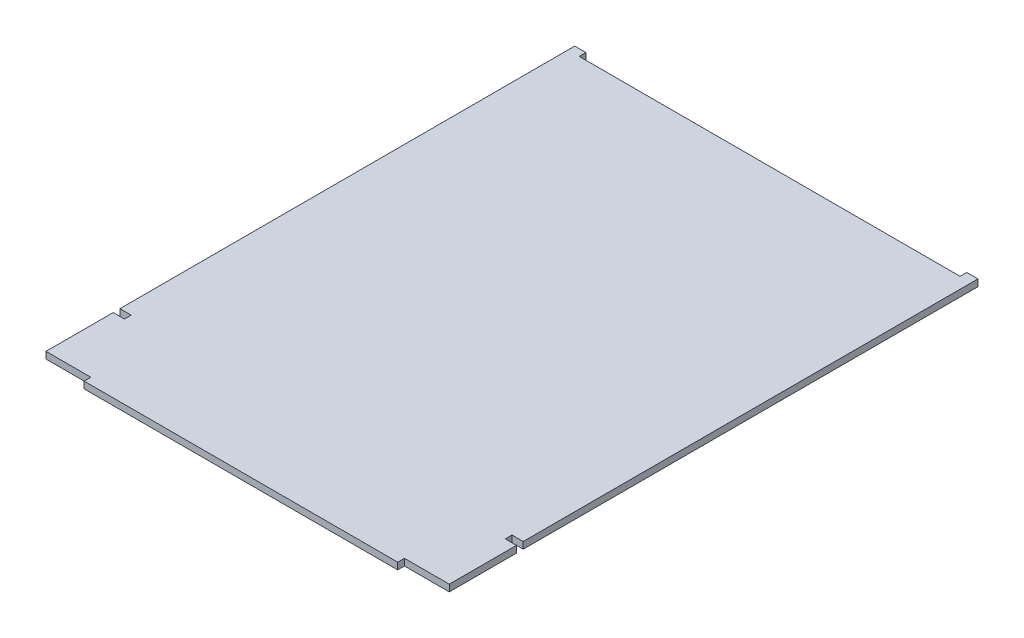
ISO-10303-21;
HEADER;
FILE_DESCRIPTION(('STEP AP214'),'2;1');
FILE_NAME('part.step','',(''),(''),'','','');
FILE_SCHEMA(('AUTOMOTIVE_DESIGN { 1 0 10303 214 1 1 1 1 }'));
ENDSEC;
DATA;
#1=APPLICATION_CONTEXT('core data for automotive mechanical design processes');
#2=APPLICATION_PROTOCOL_DEFINITION('international standard','automotive_design',2000,#1);
#3=PRODUCT_CONTEXT('',#1,'mechanical');
#4=PRODUCT('Part','Part','',(#3));
#5=PRODUCT_RELATED_PRODUCT_CATEGORY('part','',(#4));
#6=PRODUCT_DEFINITION_FORMATION('','',#4);
#7=PRODUCT_DEFINITION_CONTEXT('part definition',#1,'design');
#8=PRODUCT_DEFINITION('design','',#6,#7);
#9=PRODUCT_DEFINITION_SHAPE('','',#8);
#10=(LENGTH_UNIT() NAMED_UNIT(*) SI_UNIT(.MILLI.,.METRE.));
#11=(NAMED_UNIT(*) PLANE_ANGLE_UNIT() SI_UNIT($,.RADIAN.));
#12=(NAMED_UNIT(*) SI_UNIT($,.STERADIAN.) SOLID_ANGLE_UNIT());
#13=UNCERTAINTY_MEASURE_WITH_UNIT(LENGTH_MEASURE(1.E-05),#10,'distance_accuracy_value','');
#14=(GEOMETRIC_REPRESENTATION_CONTEXT(3) GLOBAL_UNCERTAINTY_ASSIGNED_CONTEXT((#13)) GLOBAL_UNIT_ASSIGNED_CONTEXT((#10,
#11,#12)) REPRESENTATION_CONTEXT('',''));
#15=CARTESIAN_POINT('',(0.,0.,0.));
#16=DIRECTION('',(0.,0.,1.));
#17=DIRECTION('',(1.,0.,0.));
#18=AXIS2_PLACEMENT_3D('',#15,#16,#17);
#19=CARTESIAN_POINT('',(0.,3.,3.));
#20=DIRECTION('',(0.,0.,-1.));
#21=DIRECTION('',(-1.,0.,0.));
#22=AXIS2_PLACEMENT_3D('',#19,#20,#21);
#23=PLANE('',#22);
#24=DIRECTION('',(1.,0.,0.));
#25=VECTOR('',#24,1.);
#26=CARTESIAN_POINT('',(0.,0.,3.));
#27=LINE('',#26,#25);
#28=CARTESIAN_POINT('',(160.,0.,3.));
#29=VERTEX_POINT('',#28);
#30=CARTESIAN_POINT('',(180.,0.,3.));
#31=VERTEX_POINT('',#30);
#32=EDGE_CURVE('E213',#29,#31,#27,.T.);
#33=ORIENTED_EDGE('',*,*,#32,.T.);
#34=DIRECTION('',(0.,-1.,0.));
#35=VECTOR('',#34,1.);
#36=CARTESIAN_POINT('',(180.,3.,3.));
#37=LINE('',#36,#35);
#38=CARTESIAN_POINT('',(180.,3.,3.));
#39=VERTEX_POINT('',#38);
#40=EDGE_CURVE('E11',#39,#31,#37,.T.);
#41=ORIENTED_EDGE('',*,*,#40,.F.);
#42=DIRECTION('',(1.,0.,0.));
#43=VECTOR('',#42,1.);
#44=CARTESIAN_POINT('',(0.,3.,3.));
#45=LINE('',#44,#43);
#46=CARTESIAN_POINT('',(160.,3.,3.));
#47=VERTEX_POINT('',#46);
#48=EDGE_CURVE('E284',#47,#39,#45,.T.);
#49=ORIENTED_EDGE('',*,*,#48,.F.);
#50=DIRECTION('',(0.,-1.,0.));
#51=VECTOR('',#50,1.);
#52=CARTESIAN_POINT('',(160.,3.,3.));
#53=LINE('',#52,#51);
#54=EDGE_CURVE('E209',#47,#29,#53,.T.);
#55=ORIENTED_EDGE('',*,*,#54,.T.);
#56=EDGE_LOOP('',(#33,#41,#49,#55));
#57=FACE_BOUND('',#56,.T.);
#58=ADVANCED_FACE('F39',(#57),#23,.F.);
#59=CARTESIAN_POINT('',(180.,3.,0.));
#60=DIRECTION('',(-1.,0.,0.));
#61=DIRECTION('',(0.,0.,1.));
#62=AXIS2_PLACEMENT_3D('',#59,#60,#61);
#63=PLANE('',#62);
#64=DIRECTION('',(0.,0.,-1.));
#65=VECTOR('',#64,1.);
#66=CARTESIAN_POINT('',(180.,0.,0.));
#67=LINE('',#66,#65);
#68=CARTESIAN_POINT('',(180.,0.,-27.));
#69=VERTEX_POINT('',#68);
#70=EDGE_CURVE('E217',#31,#69,#67,.T.);
#71=ORIENTED_EDGE('',*,*,#70,.T.);
#72=DIRECTION('',(0.,-1.,0.));
#73=VECTOR('',#72,1.);
#74=CARTESIAN_POINT('',(180.,3.,-27.));
#75=LINE('',#74,#73);
#76=CARTESIAN_POINT('',(180.,3.,-27.));
#77=VERTEX_POINT('',#76);
#78=EDGE_CURVE('E48',#77,#69,#75,.T.);
#79=ORIENTED_EDGE('',*,*,#78,.F.);
#80=DIRECTION('',(0.,0.,-1.));
#81=VECTOR('',#80,1.);
#82=CARTESIAN_POINT('',(180.,3.,0.));
#83=LINE('',#82,#81);
#84=EDGE_CURVE('E135',#39,#77,#83,.T.);
#85=ORIENTED_EDGE('',*,*,#84,.F.);
#86=ORIENTED_EDGE('',*,*,#40,.T.);
#87=EDGE_LOOP('',(#71,#79,#85,#86));
#88=FACE_BOUND('',#87,.T.);
#89=ADVANCED_FACE('F341',(#88),#63,.F.);
#90=CARTESIAN_POINT('',(0.,3.,-27.));
#91=DIRECTION('',(0.,0.,-1.));
#92=DIRECTION('',(-1.,0.,0.));
#93=AXIS2_PLACEMENT_3D('',#90,#91,#92);
#94=PLANE('',#93);
#95=DIRECTION('',(1.,0.,0.));
#96=VECTOR('',#95,1.);
#97=CARTESIAN_POINT('',(0.,0.,-27.));
#98=LINE('',#97,#96);
#99=CARTESIAN_POINT('',(175.,0.,-27.));
#100=VERTEX_POINT('',#99);
#101=EDGE_CURVE('E221',#100,#69,#98,.T.);
#102=ORIENTED_EDGE('',*,*,#101,.F.);
#103=DIRECTION('',(0.,-1.,0.));
#104=VECTOR('',#103,1.);
#105=CARTESIAN_POINT('',(175.,3.,-27.));
#106=LINE('',#105,#104);
#107=CARTESIAN_POINT('',(175.,3.,-27.));
#108=VERTEX_POINT('',#107);
#109=EDGE_CURVE('E332',#108,#100,#106,.T.);
#110=ORIENTED_EDGE('',*,*,#109,.F.);
#111=DIRECTION('',(1.,0.,0.));
#112=VECTOR('',#111,1.);
#113=CARTESIAN_POINT('',(0.,3.,-27.));
#114=LINE('',#113,#112);
#115=EDGE_CURVE('E340',#108,#77,#114,.T.);
#116=ORIENTED_EDGE('',*,*,#115,.T.);
#117=ORIENTED_EDGE('',*,*,#78,.T.);
#118=EDGE_LOOP('',(#102,#110,#116,#117));
#119=FACE_BOUND('',#118,.T.);
#120=ADVANCED_FACE('F338',(#119),#94,.T.);
#121=CARTESIAN_POINT('',(175.,3.,0.));
#122=DIRECTION('',(1.,0.,0.));
#123=DIRECTION('',(0.,0.,-1.));
#124=AXIS2_PLACEMENT_3D('',#121,#122,#123);
#125=PLANE('',#124);
#126=DIRECTION('',(0.,0.,1.));
#127=VECTOR('',#126,1.);
#128=CARTESIAN_POINT('',(175.,0.,0.));
#129=LINE('',#128,#127);
#130=CARTESIAN_POINT('',(175.,0.,-30.));
#131=VERTEX_POINT('',#130);
#132=EDGE_CURVE('E225',#131,#100,#129,.T.);
#133=ORIENTED_EDGE('',*,*,#132,.F.);
#134=DIRECTION('',(0.,-1.,0.));
#135=VECTOR('',#134,1.);
#136=CARTESIAN_POINT('',(175.,3.,-30.));
#137=LINE('',#136,#135);
#138=CARTESIAN_POINT('',(175.,3.,-30.));
#139=VERTEX_POINT('',#138);
#140=EDGE_CURVE('E329',#139,#131,#137,.T.);
#141=ORIENTED_EDGE('',*,*,#140,.F.);
#142=DIRECTION('',(0.,0.,1.));
#143=VECTOR('',#142,1.);
#144=CARTESIAN_POINT('',(175.,3.,0.));
#145=LINE('',#144,#143);
#146=EDGE_CURVE('E353',#139,#108,#145,.T.);
#147=ORIENTED_EDGE('',*,*,#146,.T.);
#148=ORIENTED_EDGE('',*,*,#109,.T.);
#149=EDGE_LOOP('',(#133,#141,#147,#148));
#150=FACE_BOUND('',#149,.T.);
#151=ADVANCED_FACE('F350',(#150),#125,.T.);
#152=CARTESIAN_POINT('',(0.,3.,-30.));
#153=DIRECTION('',(0.,0.,1.));
#154=DIRECTION('',(1.,0.,0.));
#155=AXIS2_PLACEMENT_3D('',#152,#153,#154);
#156=PLANE('',#155);
#157=DIRECTION('',(-1.,0.,0.));
#158=VECTOR('',#157,1.);
#159=CARTESIAN_POINT('',(0.,0.,-30.));
#160=LINE('',#159,#158);
#161=CARTESIAN_POINT('',(180.,0.,-30.));
#162=VERTEX_POINT('',#161);
#163=EDGE_CURVE('E229',#162,#131,#160,.T.);
#164=ORIENTED_EDGE('',*,*,#163,.F.);
#165=DIRECTION('',(0.,-1.,0.));
#166=VECTOR('',#165,1.);
#167=CARTESIAN_POINT('',(180.,3.,-30.));
#168=LINE('',#167,#166);
#169=CARTESIAN_POINT('',(180.,3.,-30.));
#170=VERTEX_POINT('',#169);
#171=EDGE_CURVE('E326',#170,#162,#168,.T.);
#172=ORIENTED_EDGE('',*,*,#171,.F.);
#173=DIRECTION('',(-1.,0.,0.));
#174=VECTOR('',#173,1.);
#175=CARTESIAN_POINT('',(0.,3.,-30.));
#176=LINE('',#175,#174);
#177=EDGE_CURVE('E360',#170,#139,#176,.T.);
#178=ORIENTED_EDGE('',*,*,#177,.T.);
#179=ORIENTED_EDGE('',*,*,#140,.T.);
#180=EDGE_LOOP('',(#164,#172,#178,#179));
#181=FACE_BOUND('',#180,.T.);
#182=ADVANCED_FACE('F580',(#181),#156,.T.);
#183=CARTESIAN_POINT('',(180.,3.,0.));
#184=DIRECTION('',(-1.,0.,0.));
#185=DIRECTION('',(0.,0.,1.));
#186=AXIS2_PLACEMENT_3D('',#183,#184,#185);
#187=PLANE('',#186);
#188=DIRECTION('',(0.,0.,-1.));
#189=VECTOR('',#188,1.);
#190=CARTESIAN_POINT('',(180.,0.,0.));
#191=LINE('',#190,#189);
#192=CARTESIAN_POINT('',(180.,0.,-233.));
#193=VERTEX_POINT('',#192);
#194=EDGE_CURVE('E233',#162,#193,#191,.T.);
#195=ORIENTED_EDGE('',*,*,#194,.T.);
#196=DIRECTION('',(0.,-1.,0.));
#197=VECTOR('',#196,1.);
#198=CARTESIAN_POINT('',(180.,3.,-233.));
#199=LINE('',#198,#197);
#200=CARTESIAN_POINT('',(180.,3.,-233.));
#201=VERTEX_POINT('',#200);
#202=EDGE_CURVE('E323',#201,#193,#199,.T.);
#203=ORIENTED_EDGE('',*,*,#202,.F.);
#204=DIRECTION('',(0.,0.,-1.));
#205=VECTOR('',#204,1.);
#206=CARTESIAN_POINT('',(180.,3.,0.));
#207=LINE('',#206,#205);
#208=EDGE_CURVE('E367',#170,#201,#207,.T.);
#209=ORIENTED_EDGE('',*,*,#208,.F.);
#210=ORIENTED_EDGE('',*,*,#171,.T.);
#211=EDGE_LOOP('',(#195,#203,#209,#210));
#212=FACE_BOUND('',#211,.T.);
#213=ADVANCED_FACE('F570',(#212),#187,.F.);
#214=CARTESIAN_POINT('',(0.,3.,-233.));
#215=DIRECTION('',(0.,0.,-1.));
#216=DIRECTION('',(-1.,0.,0.));
#217=AXIS2_PLACEMENT_3D('',#214,#215,#216);
#218=PLANE('',#217);
#219=DIRECTION('',(1.,0.,0.));
#220=VECTOR('',#219,1.);
#221=CARTESIAN_POINT('',(0.,0.,-233.));
#222=LINE('',#221,#220);
#223=CARTESIAN_POINT('',(175.,0.,-233.));
#224=VERTEX_POINT('',#223);
#225=EDGE_CURVE('E237',#224,#193,#222,.T.);
#226=ORIENTED_EDGE('',*,*,#225,.F.);
#227=DIRECTION('',(0.,-1.,0.));
#228=VECTOR('',#227,1.);
#229=CARTESIAN_POINT('',(175.,3.,-233.));
#230=LINE('',#229,#228);
#231=CARTESIAN_POINT('',(175.,3.,-233.));
#232=VERTEX_POINT('',#231);
#233=EDGE_CURVE('E320',#232,#224,#230,.T.);
#234=ORIENTED_EDGE('',*,*,#233,.F.);
#235=DIRECTION('',(1.,0.,0.));
#236=VECTOR('',#235,1.);
#237=CARTESIAN_POINT('',(0.,3.,-233.));
#238=LINE('',#237,#236);
#239=EDGE_CURVE('E370',#232,#201,#238,.T.);
#240=ORIENTED_EDGE('',*,*,#239,.T.);
#241=ORIENTED_EDGE('',*,*,#202,.T.);
#242=EDGE_LOOP('',(#226,#234,#240,#241));
#243=FACE_BOUND('',#242,.T.);
#244=ADVANCED_FACE('F560',(#243),#218,.T.);
#245=CARTESIAN_POINT('',(175.,3.,0.));
#246=DIRECTION('',(-1.,0.,0.));
#247=DIRECTION('',(0.,0.,1.));
#248=AXIS2_PLACEMENT_3D('',#245,#246,#247);
#249=PLANE('',#248);
#250=DIRECTION('',(0.,0.,-1.));
#251=VECTOR('',#250,1.);
#252=CARTESIAN_POINT('',(175.,0.,0.));
#253=LINE('',#252,#251);
#254=CARTESIAN_POINT('',(175.,0.,-230.));
#255=VERTEX_POINT('',#254);
#256=EDGE_CURVE('E241',#255,#224,#253,.T.);
#257=ORIENTED_EDGE('',*,*,#256,.F.);
#258=DIRECTION('',(0.,-1.,0.));
#259=VECTOR('',#258,1.);
#260=CARTESIAN_POINT('',(175.,3.,-230.));
#261=LINE('',#260,#259);
#262=CARTESIAN_POINT('',(175.,3.,-230.));
#263=VERTEX_POINT('',#262);
#264=EDGE_CURVE('E317',#263,#255,#261,.T.);
#265=ORIENTED_EDGE('',*,*,#264,.F.);
#266=DIRECTION('',(0.,0.,-1.));
#267=VECTOR('',#266,1.);
#268=CARTESIAN_POINT('',(175.,3.,0.));
#269=LINE('',#268,#267);
#270=EDGE_CURVE('E374',#263,#232,#269,.T.);
#271=ORIENTED_EDGE('',*,*,#270,.T.);
#272=ORIENTED_EDGE('',*,*,#233,.T.);
#273=EDGE_LOOP('',(#257,#265,#271,#272));
#274=FACE_BOUND('',#273,.T.);
#275=ADVANCED_FACE('F550',(#274),#249,.T.);
#276=CARTESIAN_POINT('',(0.,3.,-230.));
#277=DIRECTION('',(0.,0.,-1.));
#278=DIRECTION('',(-1.,0.,0.));
#279=AXIS2_PLACEMENT_3D('',#276,#277,#278);
#280=PLANE('',#279);
#281=DIRECTION('',(1.,0.,0.));
#282=VECTOR('',#281,1.);
#283=CARTESIAN_POINT('',(0.,0.,-230.));
#284=LINE('',#283,#282);
#285=CARTESIAN_POINT('',(5.,0.,-230.));
#286=VERTEX_POINT('',#285);
#287=EDGE_CURVE('E245',#286,#255,#284,.T.);
#288=ORIENTED_EDGE('',*,*,#287,.F.);
#289=DIRECTION('',(0.,-1.,0.));
#290=VECTOR('',#289,1.);
#291=CARTESIAN_POINT('',(5.,3.,-230.));
#292=LINE('',#291,#290);
#293=CARTESIAN_POINT('',(5.,3.,-230.));
#294=VERTEX_POINT('',#293);
#295=EDGE_CURVE('E314',#294,#286,#292,.T.);
#296=ORIENTED_EDGE('',*,*,#295,.F.);
#297=DIRECTION('',(1.,0.,0.));
#298=VECTOR('',#297,1.);
#299=CARTESIAN_POINT('',(0.,3.,-230.));
#300=LINE('',#299,#298);
#301=EDGE_CURVE('E378',#294,#263,#300,.T.);
#302=ORIENTED_EDGE('',*,*,#301,.T.);
#303=ORIENTED_EDGE('',*,*,#264,.T.);
#304=EDGE_LOOP('',(#288,#296,#302,#303));
#305=FACE_BOUND('',#304,.T.);
#306=ADVANCED_FACE('F540',(#305),#280,.T.);
#307=CARTESIAN_POINT('',(4.99999999999993,3.,0.));
#308=DIRECTION('',(1.,0.,0.));
#309=DIRECTION('',(0.,0.,-1.));
#310=AXIS2_PLACEMENT_3D('',#307,#308,#309);
#311=PLANE('',#310);
#312=DIRECTION('',(0.,0.,1.));
#313=VECTOR('',#312,1.);
#314=CARTESIAN_POINT('',(4.99999999999993,0.,0.));
#315=LINE('',#314,#313);
#316=CARTESIAN_POINT('',(5.,0.,-233.));
#317=VERTEX_POINT('',#316);
#318=EDGE_CURVE('E249',#317,#286,#315,.T.);
#319=ORIENTED_EDGE('',*,*,#318,.F.);
#320=DIRECTION('',(0.,-1.,0.));
#321=VECTOR('',#320,1.);
#322=CARTESIAN_POINT('',(5.,3.,-233.));
#323=LINE('',#322,#321);
#324=CARTESIAN_POINT('',(5.,3.,-233.));
#325=VERTEX_POINT('',#324);
#326=EDGE_CURVE('E311',#325,#317,#323,.T.);
#327=ORIENTED_EDGE('',*,*,#326,.F.);
#328=DIRECTION('',(0.,0.,1.));
#329=VECTOR('',#328,1.);
#330=CARTESIAN_POINT('',(4.99999999999993,3.,0.));
#331=LINE('',#330,#329);
#332=EDGE_CURVE('E382',#325,#294,#331,.T.);
#333=ORIENTED_EDGE('',*,*,#332,.T.);
#334=ORIENTED_EDGE('',*,*,#295,.T.);
#335=EDGE_LOOP('',(#319,#327,#333,#334));
#336=FACE_BOUND('',#335,.T.);
#337=ADVANCED_FACE('F530',(#336),#311,.T.);
#338=CARTESIAN_POINT('',(0.,3.,-233.));
#339=DIRECTION('',(0.,0.,-1.));
#340=DIRECTION('',(-1.,0.,0.));
#341=AXIS2_PLACEMENT_3D('',#338,#339,#340);
#342=PLANE('',#341);
#343=DIRECTION('',(1.,0.,0.));
#344=VECTOR('',#343,1.);
#345=CARTESIAN_POINT('',(0.,0.,-233.));
#346=LINE('',#345,#344);
#347=CARTESIAN_POINT('',(0.,0.,-233.));
#348=VERTEX_POINT('',#347);
#349=EDGE_CURVE('E253',#348,#317,#346,.T.);
#350=ORIENTED_EDGE('',*,*,#349,.F.);
#351=DIRECTION('',(0.,-1.,0.));
#352=VECTOR('',#351,1.);
#353=CARTESIAN_POINT('',(0.,3.,-233.));
#354=LINE('',#353,#352);
#355=CARTESIAN_POINT('',(0.,3.,-233.));
#356=VERTEX_POINT('',#355);
#357=EDGE_CURVE('E308',#356,#348,#354,.T.);
#358=ORIENTED_EDGE('',*,*,#357,.F.);
#359=DIRECTION('',(1.,0.,0.));
#360=VECTOR('',#359,1.);
#361=CARTESIAN_POINT('',(0.,3.,-233.));
#362=LINE('',#361,#360);
#363=EDGE_CURVE('E386',#356,#325,#362,.T.);
#364=ORIENTED_EDGE('',*,*,#363,.T.);
#365=ORIENTED_EDGE('',*,*,#326,.T.);
#366=EDGE_LOOP('',(#350,#358,#364,#365));
#367=FACE_BOUND('',#366,.T.);
#368=ADVANCED_FACE('F518',(#367),#342,.T.);
#369=CARTESIAN_POINT('',(0.,3.,0.));
#370=DIRECTION('',(-1.,0.,0.));
#371=DIRECTION('',(0.,0.,1.));
#372=AXIS2_PLACEMENT_3D('',#369,#370,#371);
#373=PLANE('',#372);
#374=DIRECTION('',(0.,0.,-1.));
#375=VECTOR('',#374,1.);
#376=CARTESIAN_POINT('',(0.,0.,0.));
#377=LINE('',#376,#375);
#378=CARTESIAN_POINT('',(0.,0.,-30.));
#379=VERTEX_POINT('',#378);
#380=EDGE_CURVE('E257',#379,#348,#377,.T.);
#381=ORIENTED_EDGE('',*,*,#380,.F.);
#382=DIRECTION('',(0.,-1.,0.));
#383=VECTOR('',#382,1.);
#384=CARTESIAN_POINT('',(0.,3.,-30.));
#385=LINE('',#384,#383);
#386=CARTESIAN_POINT('',(0.,3.,-30.));
#387=VERTEX_POINT('',#386);
#388=EDGE_CURVE('E305',#387,#379,#385,.T.);
#389=ORIENTED_EDGE('',*,*,#388,.F.);
#390=DIRECTION('',(0.,0.,-1.));
#391=VECTOR('',#390,1.);
#392=CARTESIAN_POINT('',(0.,3.,0.));
#393=LINE('',#392,#391);
#394=EDGE_CURVE('E390',#387,#356,#393,.T.);
#395=ORIENTED_EDGE('',*,*,#394,.T.);
#396=ORIENTED_EDGE('',*,*,#357,.T.);
#397=EDGE_LOOP('',(#381,#389,#395,#396));
#398=FACE_BOUND('',#397,.T.);
#399=ADVANCED_FACE('F507',(#398),#373,.T.);
#400=CARTESIAN_POINT('',(0.,3.,-30.));
#401=DIRECTION('',(0.,0.,-1.));
#402=DIRECTION('',(-1.,0.,0.));
#403=AXIS2_PLACEMENT_3D('',#400,#401,#402);
#404=PLANE('',#403);
#405=DIRECTION('',(1.,0.,0.));
#406=VECTOR('',#405,1.);
#407=CARTESIAN_POINT('',(0.,0.,-30.));
#408=LINE('',#407,#406);
#409=CARTESIAN_POINT('',(5.,0.,-30.));
#410=VERTEX_POINT('',#409);
#411=EDGE_CURVE('E261',#379,#410,#408,.T.);
#412=ORIENTED_EDGE('',*,*,#411,.T.);
#413=DIRECTION('',(0.,-1.,0.));
#414=VECTOR('',#413,1.);
#415=CARTESIAN_POINT('',(5.,3.,-30.));
#416=LINE('',#415,#414);
#417=CARTESIAN_POINT('',(5.,3.,-30.));
#418=VERTEX_POINT('',#417);
#419=EDGE_CURVE('E301',#418,#410,#416,.T.);
#420=ORIENTED_EDGE('',*,*,#419,.F.);
#421=DIRECTION('',(1.,0.,0.));
#422=VECTOR('',#421,1.);
#423=CARTESIAN_POINT('',(0.,3.,-30.));
#424=LINE('',#423,#422);
#425=EDGE_CURVE('E394',#387,#418,#424,.T.);
#426=ORIENTED_EDGE('',*,*,#425,.F.);
#427=ORIENTED_EDGE('',*,*,#388,.T.);
#428=EDGE_LOOP('',(#412,#420,#426,#427));
#429=FACE_BOUND('',#428,.T.);
#430=ADVANCED_FACE('F497',(#429),#404,.F.);
#431=CARTESIAN_POINT('',(5.,3.,0.));
#432=DIRECTION('',(1.,0.,0.));
#433=DIRECTION('',(0.,0.,-1.));
#434=AXIS2_PLACEMENT_3D('',#431,#432,#433);
#435=PLANE('',#434);
#436=DIRECTION('',(0.,0.,1.));
#437=VECTOR('',#436,1.);
#438=CARTESIAN_POINT('',(5.,0.,0.));
#439=LINE('',#438,#437);
#440=CARTESIAN_POINT('',(5.,0.,-27.));
#441=VERTEX_POINT('',#440);
#442=EDGE_CURVE('E264',#410,#441,#439,.T.);
#443=ORIENTED_EDGE('',*,*,#442,.T.);
#444=DIRECTION('',(0.,-1.,0.));
#445=VECTOR('',#444,1.);
#446=CARTESIAN_POINT('',(5.,3.,-27.));
#447=LINE('',#446,#445);
#448=CARTESIAN_POINT('',(5.,3.,-27.));
#449=VERTEX_POINT('',#448);
#450=EDGE_CURVE('E297',#449,#441,#447,.T.);
#451=ORIENTED_EDGE('',*,*,#450,.F.);
#452=DIRECTION('',(0.,0.,1.));
#453=VECTOR('',#452,1.);
#454=CARTESIAN_POINT('',(5.,3.,0.));
#455=LINE('',#454,#453);
#456=EDGE_CURVE('E397',#418,#449,#455,.T.);
#457=ORIENTED_EDGE('',*,*,#456,.F.);
#458=ORIENTED_EDGE('',*,*,#419,.T.);
#459=EDGE_LOOP('',(#443,#451,#457,#458));
#460=FACE_BOUND('',#459,.T.);
#461=ADVANCED_FACE('F488',(#460),#435,.F.);
#462=CARTESIAN_POINT('',(0.,3.,-27.));
#463=DIRECTION('',(0.,0.,1.));
#464=DIRECTION('',(1.,0.,0.));
#465=AXIS2_PLACEMENT_3D('',#462,#463,#464);
#466=PLANE('',#465);
#467=DIRECTION('',(-1.,0.,0.));
#468=VECTOR('',#467,1.);
#469=CARTESIAN_POINT('',(0.,0.,-27.));
#470=LINE('',#469,#468);
#471=CARTESIAN_POINT('',(0.,0.,-27.));
#472=VERTEX_POINT('',#471);
#473=EDGE_CURVE('E267',#441,#472,#470,.T.);
#474=ORIENTED_EDGE('',*,*,#473,.T.);
#475=DIRECTION('',(0.,-1.,0.));
#476=VECTOR('',#475,1.);
#477=CARTESIAN_POINT('',(0.,3.,-27.));
#478=LINE('',#477,#476);
#479=CARTESIAN_POINT('',(0.,3.,-27.));
#480=VERTEX_POINT('',#479);
#481=EDGE_CURVE('E294',#480,#472,#478,.T.);
#482=ORIENTED_EDGE('',*,*,#481,.F.);
#483=DIRECTION('',(-1.,0.,0.));
#484=VECTOR('',#483,1.);
#485=CARTESIAN_POINT('',(0.,3.,-27.));
#486=LINE('',#485,#484);
#487=EDGE_CURVE('E400',#449,#480,#486,.T.);
#488=ORIENTED_EDGE('',*,*,#487,.F.);
#489=ORIENTED_EDGE('',*,*,#450,.T.);
#490=EDGE_LOOP('',(#474,#482,#488,#489));
#491=FACE_BOUND('',#490,.T.);
#492=ADVANCED_FACE('F415',(#491),#466,.F.);
#493=CARTESIAN_POINT('',(0.,3.,0.));
#494=DIRECTION('',(-1.,0.,0.));
#495=DIRECTION('',(0.,0.,1.));
#496=AXIS2_PLACEMENT_3D('',#493,#494,#495);
#497=PLANE('',#496);
#498=DIRECTION('',(0.,0.,-1.));
#499=VECTOR('',#498,1.);
#500=CARTESIAN_POINT('',(0.,0.,0.));
#501=LINE('',#500,#499);
#502=CARTESIAN_POINT('',(0.,0.,3.));
#503=VERTEX_POINT('',#502);
#504=EDGE_CURVE('E271',#503,#472,#501,.T.);
#505=ORIENTED_EDGE('',*,*,#504,.F.);
#506=DIRECTION('',(0.,-1.,0.));
#507=VECTOR('',#506,1.);
#508=CARTESIAN_POINT('',(0.,3.,3.));
#509=LINE('',#508,#507);
#510=CARTESIAN_POINT('',(0.,3.,3.));
#511=VERTEX_POINT('',#510);
#512=EDGE_CURVE('E291',#511,#503,#509,.T.);
#513=ORIENTED_EDGE('',*,*,#512,.F.);
#514=DIRECTION('',(0.,0.,-1.));
#515=VECTOR('',#514,1.);
#516=CARTESIAN_POINT('',(0.,3.,0.));
#517=LINE('',#516,#515);
#518=EDGE_CURVE('E403',#511,#480,#517,.T.);
#519=ORIENTED_EDGE('',*,*,#518,.T.);
#520=ORIENTED_EDGE('',*,*,#481,.T.);
#521=EDGE_LOOP('',(#505,#513,#519,#520));
#522=FACE_BOUND('',#521,.T.);
#523=ADVANCED_FACE('F409',(#522),#497,.T.);
#524=CARTESIAN_POINT('',(0.,3.,3.));
#525=DIRECTION('',(0.,0.,-1.));
#526=DIRECTION('',(-1.,0.,0.));
#527=AXIS2_PLACEMENT_3D('',#524,#525,#526);
#528=PLANE('',#527);
#529=DIRECTION('',(1.,0.,0.));
#530=VECTOR('',#529,1.);
#531=CARTESIAN_POINT('',(0.,0.,3.));
#532=LINE('',#531,#530);
#533=CARTESIAN_POINT('',(20.,0.,3.));
#534=VERTEX_POINT('',#533);
#535=EDGE_CURVE('E275',#503,#534,#532,.T.);
#536=ORIENTED_EDGE('',*,*,#535,.T.);
#537=DIRECTION('',(0.,-1.,0.));
#538=VECTOR('',#537,1.);
#539=CARTESIAN_POINT('',(20.,3.,3.));
#540=LINE('',#539,#538);
#541=CARTESIAN_POINT('',(20.,3.,3.));
#542=VERTEX_POINT('',#541);
#543=EDGE_CURVE('E202',#542,#534,#540,.T.);
#544=ORIENTED_EDGE('',*,*,#543,.F.);
#545=DIRECTION('',(1.,0.,0.));
#546=VECTOR('',#545,1.);
#547=CARTESIAN_POINT('',(0.,3.,3.));
#548=LINE('',#547,#546);
#549=EDGE_CURVE('E191',#511,#542,#548,.T.);
#550=ORIENTED_EDGE('',*,*,#549,.F.);
#551=ORIENTED_EDGE('',*,*,#512,.T.);
#552=EDGE_LOOP('',(#536,#544,#550,#551));
#553=FACE_BOUND('',#552,.T.);
#554=ADVANCED_FACE('F420',(#553),#528,.F.);
#555=CARTESIAN_POINT('',(20.,3.,0.));
#556=DIRECTION('',(1.,0.,0.));
#557=DIRECTION('',(0.,0.,-1.));
#558=AXIS2_PLACEMENT_3D('',#555,#556,#557);
#559=PLANE('',#558);
#560=DIRECTION('',(0.,0.,1.));
#561=VECTOR('',#560,1.);
#562=CARTESIAN_POINT('',(20.,0.,0.));
#563=LINE('',#562,#561);
#564=CARTESIAN_POINT('',(20.,0.,6.));
#565=VERTEX_POINT('',#564);
#566=EDGE_CURVE('E200',#534,#565,#563,.T.);
#567=ORIENTED_EDGE('',*,*,#566,.T.);
#568=DIRECTION('',(0.,-1.,0.));
#569=VECTOR('',#568,1.);
#570=CARTESIAN_POINT('',(20.,3.,6.));
#571=LINE('',#570,#569);
#572=CARTESIAN_POINT('',(20.,3.,6.));
#573=VERTEX_POINT('',#572);
#574=EDGE_CURVE('E197',#573,#565,#571,.T.);
#575=ORIENTED_EDGE('',*,*,#574,.F.);
#576=DIRECTION('',(0.,0.,1.));
#577=VECTOR('',#576,1.);
#578=CARTESIAN_POINT('',(20.,3.,0.));
#579=LINE('',#578,#577);
#580=EDGE_CURVE('E184',#542,#573,#579,.T.);
#581=ORIENTED_EDGE('',*,*,#580,.F.);
#582=ORIENTED_EDGE('',*,*,#543,.T.);
#583=EDGE_LOOP('',(#567,#575,#581,#582));
#584=FACE_BOUND('',#583,.T.);
#585=ADVANCED_FACE('F198',(#584),#559,.F.);
#586=CARTESIAN_POINT('',(0.,3.,6.));
#587=DIRECTION('',(0.,0.,-1.));
#588=DIRECTION('',(-1.,0.,0.));
#589=AXIS2_PLACEMENT_3D('',#586,#587,#588);
#590=PLANE('',#589);
#591=DIRECTION('',(1.,0.,0.));
#592=VECTOR('',#591,1.);
#593=CARTESIAN_POINT('',(0.,0.,6.));
#594=LINE('',#593,#592);
#595=CARTESIAN_POINT('',(160.,0.,6.));
#596=VERTEX_POINT('',#595);
#597=EDGE_CURVE('E121',#565,#596,#594,.T.);
#598=ORIENTED_EDGE('',*,*,#597,.T.);
#599=DIRECTION('',(0.,-1.,0.));
#600=VECTOR('',#599,1.);
#601=CARTESIAN_POINT('',(160.,3.,6.));
#602=LINE('',#601,#600);
#603=CARTESIAN_POINT('',(160.,3.,6.));
#604=VERTEX_POINT('',#603);
#605=EDGE_CURVE('E203',#604,#596,#602,.T.);
#606=ORIENTED_EDGE('',*,*,#605,.F.);
#607=DIRECTION('',(1.,0.,0.));
#608=VECTOR('',#607,1.);
#609=CARTESIAN_POINT('',(0.,3.,6.));
#610=LINE('',#609,#608);
#611=EDGE_CURVE('E188',#573,#604,#610,.T.);
#612=ORIENTED_EDGE('',*,*,#611,.F.);
#613=ORIENTED_EDGE('',*,*,#574,.T.);
#614=EDGE_LOOP('',(#598,#606,#612,#613));
#615=FACE_BOUND('',#614,.T.);
#616=ADVANCED_FACE('F205',(#615),#590,.F.);
#617=CARTESIAN_POINT('',(160.,3.,0.));
#618=DIRECTION('',(-1.,0.,0.));
#619=DIRECTION('',(0.,0.,1.));
#620=AXIS2_PLACEMENT_3D('',#617,#618,#619);
#621=PLANE('',#620);
#622=DIRECTION('',(0.,0.,-1.));
#623=VECTOR('',#622,1.);
#624=CARTESIAN_POINT('',(160.,0.,0.));
#625=LINE('',#624,#623);
#626=EDGE_CURVE('E127',#596,#29,#625,.T.);
#627=ORIENTED_EDGE('',*,*,#626,.T.);
#628=ORIENTED_EDGE('',*,*,#54,.F.);
#629=DIRECTION('',(0.,0.,-1.));
#630=VECTOR('',#629,1.);
#631=CARTESIAN_POINT('',(160.,3.,0.));
#632=LINE('',#631,#630);
#633=EDGE_CURVE('E56',#604,#47,#632,.T.);
#634=ORIENTED_EDGE('',*,*,#633,.F.);
#635=ORIENTED_EDGE('',*,*,#605,.T.);
#636=EDGE_LOOP('',(#627,#628,#634,#635));
#637=FACE_BOUND('',#636,.T.);
#638=ADVANCED_FACE('F435',(#637),#621,.F.);
#639=CARTESIAN_POINT('',(0.,3.,0.));
#640=DIRECTION('',(0.,1.,0.));
#641=DIRECTION('',(0.,0.,1.));
#642=AXIS2_PLACEMENT_3D('',#639,#640,#641);
#643=PLANE('',#642);
#644=ORIENTED_EDGE('',*,*,#48,.T.);
#645=ORIENTED_EDGE('',*,*,#84,.T.);
#646=ORIENTED_EDGE('',*,*,#115,.F.);
#647=ORIENTED_EDGE('',*,*,#146,.F.);
#648=ORIENTED_EDGE('',*,*,#177,.F.);
#649=ORIENTED_EDGE('',*,*,#208,.T.);
#650=ORIENTED_EDGE('',*,*,#239,.F.);
#651=ORIENTED_EDGE('',*,*,#270,.F.);
#652=ORIENTED_EDGE('',*,*,#301,.F.);
#653=ORIENTED_EDGE('',*,*,#332,.F.);
#654=ORIENTED_EDGE('',*,*,#363,.F.);
#655=ORIENTED_EDGE('',*,*,#394,.F.);
#656=ORIENTED_EDGE('',*,*,#425,.T.);
#657=ORIENTED_EDGE('',*,*,#456,.T.);
#658=ORIENTED_EDGE('',*,*,#487,.T.);
#659=ORIENTED_EDGE('',*,*,#518,.F.);
#660=ORIENTED_EDGE('',*,*,#549,.T.);
#661=ORIENTED_EDGE('',*,*,#580,.T.);
#662=ORIENTED_EDGE('',*,*,#611,.T.);
#663=ORIENTED_EDGE('',*,*,#633,.T.);
#664=EDGE_LOOP('',(#644,#645,#646,#647,#648,#649,#650,#651,#652,#653,#654,#655,#656,#657,#658,
#659,#660,#661,#662,#663));
#665=FACE_BOUND('',#664,.T.);
#666=ADVANCED_FACE('F186',(#665),#643,.T.);
#667=CARTESIAN_POINT('',(0.,0.,0.));
#668=DIRECTION('',(0.,1.,0.));
#669=DIRECTION('',(0.,0.,1.));
#670=AXIS2_PLACEMENT_3D('',#667,#668,#669);
#671=PLANE('',#670);
#672=ORIENTED_EDGE('',*,*,#32,.F.);
#673=ORIENTED_EDGE('',*,*,#626,.F.);
#674=ORIENTED_EDGE('',*,*,#597,.F.);
#675=ORIENTED_EDGE('',*,*,#566,.F.);
#676=ORIENTED_EDGE('',*,*,#535,.F.);
#677=ORIENTED_EDGE('',*,*,#504,.T.);
#678=ORIENTED_EDGE('',*,*,#473,.F.);
#679=ORIENTED_EDGE('',*,*,#442,.F.);
#680=ORIENTED_EDGE('',*,*,#411,.F.);
#681=ORIENTED_EDGE('',*,*,#380,.T.);
#682=ORIENTED_EDGE('',*,*,#349,.T.);
#683=ORIENTED_EDGE('',*,*,#318,.T.);
#684=ORIENTED_EDGE('',*,*,#287,.T.);
#685=ORIENTED_EDGE('',*,*,#256,.T.);
#686=ORIENTED_EDGE('',*,*,#225,.T.);
#687=ORIENTED_EDGE('',*,*,#194,.F.);
#688=ORIENTED_EDGE('',*,*,#163,.T.);
#689=ORIENTED_EDGE('',*,*,#132,.T.);
#690=ORIENTED_EDGE('',*,*,#101,.T.);
#691=ORIENTED_EDGE('',*,*,#70,.F.);
#692=EDGE_LOOP('',(#672,#673,#674,#675,#676,#677,#678,#679,#680,#681,#682,#683,#684,#685,#686,
#687,#688,#689,#690,#691));
#693=FACE_BOUND('',#692,.T.);
#694=ADVANCED_FACE('F345',(#693),#671,.F.);
#695=CLOSED_SHELL('',(#58,#89,#120,#151,#182,#213,#244,#275,#306,#337,#368,#399,#430,#461,#492,
#523,#554,#585,#616,#638,#666,#694));
#696=MANIFOLD_SOLID_BREP('B2',#695);
#697=ADVANCED_BREP_SHAPE_REPRESENTATION('',(#18,#696),#14);
#698=SHAPE_DEFINITION_REPRESENTATION(#9,#697);
ENDSEC;
END-ISO-10303-21;
